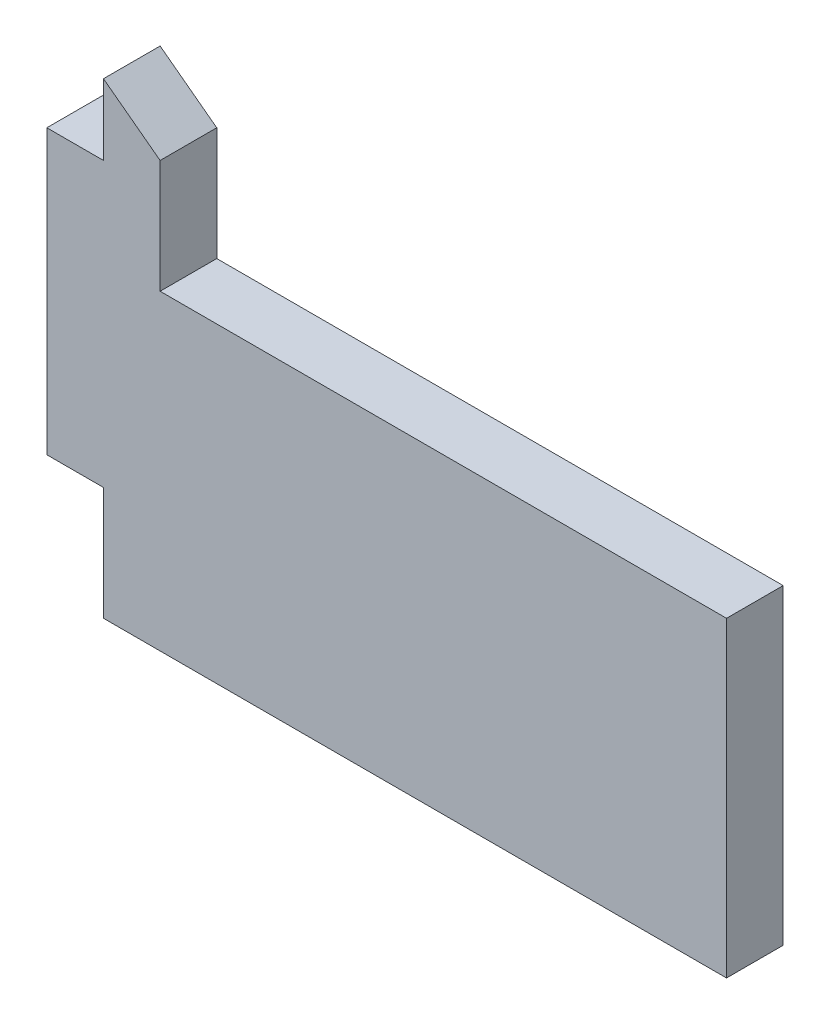
ISO-10303-21;
HEADER;
FILE_DESCRIPTION(('STEP AP214'),'2;1');
FILE_NAME('part.step','',(''),(''),'','','');
FILE_SCHEMA(('AUTOMOTIVE_DESIGN { 1 0 10303 214 1 1 1 1 }'));
ENDSEC;
DATA;
#1=APPLICATION_CONTEXT('core data for automotive mechanical design processes');
#2=APPLICATION_PROTOCOL_DEFINITION('international standard','automotive_design',2000,#1);
#3=PRODUCT_CONTEXT('',#1,'mechanical');
#4=PRODUCT('Part','Part','',(#3));
#5=PRODUCT_RELATED_PRODUCT_CATEGORY('part','',(#4));
#6=PRODUCT_DEFINITION_FORMATION('','',#4);
#7=PRODUCT_DEFINITION_CONTEXT('part definition',#1,'design');
#8=PRODUCT_DEFINITION('design','',#6,#7);
#9=PRODUCT_DEFINITION_SHAPE('','',#8);
#10=(LENGTH_UNIT() NAMED_UNIT(*) SI_UNIT(.MILLI.,.METRE.));
#11=(NAMED_UNIT(*) PLANE_ANGLE_UNIT() SI_UNIT($,.RADIAN.));
#12=(NAMED_UNIT(*) SI_UNIT($,.STERADIAN.) SOLID_ANGLE_UNIT());
#13=UNCERTAINTY_MEASURE_WITH_UNIT(LENGTH_MEASURE(1.E-05),#10,'distance_accuracy_value','');
#14=(GEOMETRIC_REPRESENTATION_CONTEXT(3) GLOBAL_UNCERTAINTY_ASSIGNED_CONTEXT((#13)) GLOBAL_UNIT_ASSIGNED_CONTEXT((#10,
#11,#12)) REPRESENTATION_CONTEXT('',''));
#15=CARTESIAN_POINT('',(0.,0.,0.));
#16=DIRECTION('',(0.,0.,1.));
#17=DIRECTION('',(1.,0.,0.));
#18=AXIS2_PLACEMENT_3D('',#15,#16,#17);
#19=CARTESIAN_POINT('',(2.,0.,2.));
#20=DIRECTION('',(0.,1.,0.));
#21=DIRECTION('',(0.,0.,1.));
#22=AXIS2_PLACEMENT_3D('',#19,#20,#21);
#23=PLANE('',#22);
#24=DIRECTION('',(1.,0.,0.));
#25=VECTOR('',#24,1.);
#26=CARTESIAN_POINT('',(2.,0.,0.));
#27=LINE('',#26,#25);
#28=CARTESIAN_POINT('',(0.,0.,0.));
#29=VERTEX_POINT('',#28);
#30=CARTESIAN_POINT('',(2.,0.,0.));
#31=VERTEX_POINT('',#30);
#32=EDGE_CURVE('E144',#29,#31,#27,.T.);
#33=ORIENTED_EDGE('',*,*,#32,.T.);
#34=DIRECTION('',(0.,0.,-1.));
#35=VECTOR('',#34,1.);
#36=CARTESIAN_POINT('',(2.,0.,2.));
#37=LINE('',#36,#35);
#38=CARTESIAN_POINT('',(2.,0.,2.));
#39=VERTEX_POINT('',#38);
#40=EDGE_CURVE('E11',#39,#31,#37,.T.);
#41=ORIENTED_EDGE('',*,*,#40,.F.);
#42=DIRECTION('',(1.,0.,0.));
#43=VECTOR('',#42,1.);
#44=CARTESIAN_POINT('',(2.,0.,2.));
#45=LINE('',#44,#43);
#46=CARTESIAN_POINT('',(0.,0.,2.));
#47=VERTEX_POINT('',#46);
#48=EDGE_CURVE('E162',#47,#39,#45,.T.);
#49=ORIENTED_EDGE('',*,*,#48,.F.);
#50=DIRECTION('',(0.,0.,-1.));
#51=VECTOR('',#50,1.);
#52=CARTESIAN_POINT('',(0.,0.,2.));
#53=LINE('',#52,#51);
#54=EDGE_CURVE('E140',#47,#29,#53,.T.);
#55=ORIENTED_EDGE('',*,*,#54,.T.);
#56=EDGE_LOOP('',(#33,#41,#49,#55));
#57=FACE_BOUND('',#56,.T.);
#58=ADVANCED_FACE('F36',(#57),#23,.F.);
#59=CARTESIAN_POINT('',(2.,-4.,2.));
#60=DIRECTION('',(1.,0.,0.));
#61=DIRECTION('',(0.,0.,-1.));
#62=AXIS2_PLACEMENT_3D('',#59,#60,#61);
#63=PLANE('',#62);
#64=DIRECTION('',(0.,-1.,0.));
#65=VECTOR('',#64,1.);
#66=CARTESIAN_POINT('',(2.,-4.,0.));
#67=LINE('',#66,#65);
#68=CARTESIAN_POINT('',(2.,-4.,0.));
#69=VERTEX_POINT('',#68);
#70=EDGE_CURVE('E147',#31,#69,#67,.T.);
#71=ORIENTED_EDGE('',*,*,#70,.T.);
#72=DIRECTION('',(0.,0.,-1.));
#73=VECTOR('',#72,1.);
#74=CARTESIAN_POINT('',(2.,-4.,2.));
#75=LINE('',#74,#73);
#76=CARTESIAN_POINT('',(2.,-4.,2.));
#77=VERTEX_POINT('',#76);
#78=EDGE_CURVE('E44',#77,#69,#75,.T.);
#79=ORIENTED_EDGE('',*,*,#78,.F.);
#80=DIRECTION('',(0.,-1.,0.));
#81=VECTOR('',#80,1.);
#82=CARTESIAN_POINT('',(2.,-4.,2.));
#83=LINE('',#82,#81);
#84=EDGE_CURVE('E101',#39,#77,#83,.T.);
#85=ORIENTED_EDGE('',*,*,#84,.F.);
#86=ORIENTED_EDGE('',*,*,#40,.T.);
#87=EDGE_LOOP('',(#71,#79,#85,#86));
#88=FACE_BOUND('',#87,.T.);
#89=ADVANCED_FACE('F211',(#88),#63,.F.);
#90=CARTESIAN_POINT('',(24.,-4.,2.));
#91=DIRECTION('',(0.,1.,0.));
#92=DIRECTION('',(-1.,0.,0.));
#93=AXIS2_PLACEMENT_3D('',#90,#91,#92);
#94=PLANE('',#93);
#95=DIRECTION('',(1.,0.,0.));
#96=VECTOR('',#95,1.);
#97=CARTESIAN_POINT('',(24.,-4.,0.));
#98=LINE('',#97,#96);
#99=CARTESIAN_POINT('',(24.,-4.,0.));
#100=VERTEX_POINT('',#99);
#101=EDGE_CURVE('E149',#69,#100,#98,.T.);
#102=ORIENTED_EDGE('',*,*,#101,.T.);
#103=DIRECTION('',(0.,0.,-1.));
#104=VECTOR('',#103,1.);
#105=CARTESIAN_POINT('',(24.,-4.,2.));
#106=LINE('',#105,#104);
#107=CARTESIAN_POINT('',(24.,-4.,2.));
#108=VERTEX_POINT('',#107);
#109=EDGE_CURVE('E175',#108,#100,#106,.T.);
#110=ORIENTED_EDGE('',*,*,#109,.F.);
#111=DIRECTION('',(1.,0.,0.));
#112=VECTOR('',#111,1.);
#113=CARTESIAN_POINT('',(24.,-4.,2.));
#114=LINE('',#113,#112);
#115=EDGE_CURVE('E183',#77,#108,#114,.T.);
#116=ORIENTED_EDGE('',*,*,#115,.F.);
#117=ORIENTED_EDGE('',*,*,#78,.T.);
#118=EDGE_LOOP('',(#102,#110,#116,#117));
#119=FACE_BOUND('',#118,.T.);
#120=ADVANCED_FACE('F181',(#119),#94,.F.);
#121=CARTESIAN_POINT('',(24.,7.00000000000001,2.));
#122=DIRECTION('',(-1.,0.,0.));
#123=DIRECTION('',(0.,-1.,0.));
#124=AXIS2_PLACEMENT_3D('',#121,#122,#123);
#125=PLANE('',#124);
#126=DIRECTION('',(0.,1.,0.));
#127=VECTOR('',#126,1.);
#128=CARTESIAN_POINT('',(24.,7.00000000000001,0.));
#129=LINE('',#128,#127);
#130=CARTESIAN_POINT('',(24.,7.00000000000001,0.));
#131=VERTEX_POINT('',#130);
#132=EDGE_CURVE('E151',#100,#131,#129,.T.);
#133=ORIENTED_EDGE('',*,*,#132,.T.);
#134=DIRECTION('',(0.,0.,-1.));
#135=VECTOR('',#134,1.);
#136=CARTESIAN_POINT('',(24.,7.00000000000001,2.));
#137=LINE('',#136,#135);
#138=CARTESIAN_POINT('',(24.,7.00000000000001,2.));
#139=VERTEX_POINT('',#138);
#140=EDGE_CURVE('E172',#139,#131,#137,.T.);
#141=ORIENTED_EDGE('',*,*,#140,.F.);
#142=DIRECTION('',(0.,1.,0.));
#143=VECTOR('',#142,1.);
#144=CARTESIAN_POINT('',(24.,7.00000000000001,2.));
#145=LINE('',#144,#143);
#146=EDGE_CURVE('E201',#108,#139,#145,.T.);
#147=ORIENTED_EDGE('',*,*,#146,.F.);
#148=ORIENTED_EDGE('',*,*,#109,.T.);
#149=EDGE_LOOP('',(#133,#141,#147,#148));
#150=FACE_BOUND('',#149,.T.);
#151=ADVANCED_FACE('F192',(#150),#125,.F.);
#152=CARTESIAN_POINT('',(4.,7.00000000000001,2.));
#153=DIRECTION('',(0.,-1.,0.));
#154=DIRECTION('',(0.,0.,-1.));
#155=AXIS2_PLACEMENT_3D('',#152,#153,#154);
#156=PLANE('',#155);
#157=DIRECTION('',(-1.,0.,0.));
#158=VECTOR('',#157,1.);
#159=CARTESIAN_POINT('',(4.,7.00000000000001,0.));
#160=LINE('',#159,#158);
#161=CARTESIAN_POINT('',(4.,7.00000000000001,0.));
#162=VERTEX_POINT('',#161);
#163=EDGE_CURVE('E153',#131,#162,#160,.T.);
#164=ORIENTED_EDGE('',*,*,#163,.T.);
#165=DIRECTION('',(0.,0.,-1.));
#166=VECTOR('',#165,1.);
#167=CARTESIAN_POINT('',(4.,7.00000000000001,2.));
#168=LINE('',#167,#166);
#169=CARTESIAN_POINT('',(4.,7.00000000000001,2.));
#170=VERTEX_POINT('',#169);
#171=EDGE_CURVE('E169',#170,#162,#168,.T.);
#172=ORIENTED_EDGE('',*,*,#171,.F.);
#173=DIRECTION('',(-1.,0.,0.));
#174=VECTOR('',#173,1.);
#175=CARTESIAN_POINT('',(4.,7.00000000000001,2.));
#176=LINE('',#175,#174);
#177=EDGE_CURVE('E198',#139,#170,#176,.T.);
#178=ORIENTED_EDGE('',*,*,#177,.F.);
#179=ORIENTED_EDGE('',*,*,#140,.T.);
#180=EDGE_LOOP('',(#164,#172,#178,#179));
#181=FACE_BOUND('',#180,.T.);
#182=ADVANCED_FACE('F196',(#181),#156,.F.);
#183=CARTESIAN_POINT('',(4.,11.,2.));
#184=DIRECTION('',(-1.,0.,0.));
#185=DIRECTION('',(0.,-1.,0.));
#186=AXIS2_PLACEMENT_3D('',#183,#184,#185);
#187=PLANE('',#186);
#188=DIRECTION('',(0.,1.,0.));
#189=VECTOR('',#188,1.);
#190=CARTESIAN_POINT('',(4.,11.,0.));
#191=LINE('',#190,#189);
#192=CARTESIAN_POINT('',(4.,11.,0.));
#193=VERTEX_POINT('',#192);
#194=EDGE_CURVE('E155',#162,#193,#191,.T.);
#195=ORIENTED_EDGE('',*,*,#194,.T.);
#196=DIRECTION('',(0.,0.,-1.));
#197=VECTOR('',#196,1.);
#198=CARTESIAN_POINT('',(4.,11.,2.));
#199=LINE('',#198,#197);
#200=CARTESIAN_POINT('',(4.,11.,2.));
#201=VERTEX_POINT('',#200);
#202=EDGE_CURVE('E166',#201,#193,#199,.T.);
#203=ORIENTED_EDGE('',*,*,#202,.F.);
#204=DIRECTION('',(0.,1.,0.));
#205=VECTOR('',#204,1.);
#206=CARTESIAN_POINT('',(4.,11.,2.));
#207=LINE('',#206,#205);
#208=EDGE_CURVE('E200',#170,#201,#207,.T.);
#209=ORIENTED_EDGE('',*,*,#208,.F.);
#210=ORIENTED_EDGE('',*,*,#171,.T.);
#211=EDGE_LOOP('',(#195,#203,#209,#210));
#212=FACE_BOUND('',#211,.T.);
#213=ADVANCED_FACE('F223',(#212),#187,.F.);
#214=CARTESIAN_POINT('',(2.,12.5,2.));
#215=DIRECTION('',(-0.6,-0.8,0.));
#216=DIRECTION('',(0.8,-0.6,0.));
#217=AXIS2_PLACEMENT_3D('',#214,#215,#216);
#218=PLANE('',#217);
#219=DIRECTION('',(-0.8,0.6,0.));
#220=VECTOR('',#219,1.);
#221=CARTESIAN_POINT('',(2.,12.5,0.));
#222=LINE('',#221,#220);
#223=CARTESIAN_POINT('',(2.,12.5,0.));
#224=VERTEX_POINT('',#223);
#225=EDGE_CURVE('E157',#193,#224,#222,.T.);
#226=ORIENTED_EDGE('',*,*,#225,.T.);
#227=DIRECTION('',(0.,0.,-1.));
#228=VECTOR('',#227,1.);
#229=CARTESIAN_POINT('',(2.,12.5,2.));
#230=LINE('',#229,#228);
#231=CARTESIAN_POINT('',(2.,12.5,2.));
#232=VERTEX_POINT('',#231);
#233=EDGE_CURVE('E135',#232,#224,#230,.T.);
#234=ORIENTED_EDGE('',*,*,#233,.F.);
#235=DIRECTION('',(-0.8,0.6,0.));
#236=VECTOR('',#235,1.);
#237=CARTESIAN_POINT('',(2.,12.5,2.));
#238=LINE('',#237,#236);
#239=EDGE_CURVE('E126',#201,#232,#238,.T.);
#240=ORIENTED_EDGE('',*,*,#239,.F.);
#241=ORIENTED_EDGE('',*,*,#202,.T.);
#242=EDGE_LOOP('',(#226,#234,#240,#241));
#243=FACE_BOUND('',#242,.T.);
#244=ADVANCED_FACE('F226',(#243),#218,.F.);
#245=CARTESIAN_POINT('',(2.,10.,2.));
#246=DIRECTION('',(1.,0.,0.));
#247=DIRECTION('',(0.,0.,-1.));
#248=AXIS2_PLACEMENT_3D('',#245,#246,#247);
#249=PLANE('',#248);
#250=DIRECTION('',(0.,-1.,0.));
#251=VECTOR('',#250,1.);
#252=CARTESIAN_POINT('',(2.,10.,0.));
#253=LINE('',#252,#251);
#254=CARTESIAN_POINT('',(2.,10.,0.));
#255=VERTEX_POINT('',#254);
#256=EDGE_CURVE('E134',#224,#255,#253,.T.);
#257=ORIENTED_EDGE('',*,*,#256,.T.);
#258=DIRECTION('',(0.,0.,-1.));
#259=VECTOR('',#258,1.);
#260=CARTESIAN_POINT('',(2.,10.,2.));
#261=LINE('',#260,#259);
#262=CARTESIAN_POINT('',(2.,10.,2.));
#263=VERTEX_POINT('',#262);
#264=EDGE_CURVE('E131',#263,#255,#261,.T.);
#265=ORIENTED_EDGE('',*,*,#264,.F.);
#266=DIRECTION('',(0.,-1.,0.));
#267=VECTOR('',#266,1.);
#268=CARTESIAN_POINT('',(2.,10.,2.));
#269=LINE('',#268,#267);
#270=EDGE_CURVE('E120',#232,#263,#269,.T.);
#271=ORIENTED_EDGE('',*,*,#270,.F.);
#272=ORIENTED_EDGE('',*,*,#233,.T.);
#273=EDGE_LOOP('',(#257,#265,#271,#272));
#274=FACE_BOUND('',#273,.T.);
#275=ADVANCED_FACE('F132',(#274),#249,.F.);
#276=CARTESIAN_POINT('',(0.,10.,2.));
#277=DIRECTION('',(0.,-1.,0.));
#278=DIRECTION('',(0.,0.,-1.));
#279=AXIS2_PLACEMENT_3D('',#276,#277,#278);
#280=PLANE('',#279);
#281=DIRECTION('',(-1.,0.,0.));
#282=VECTOR('',#281,1.);
#283=CARTESIAN_POINT('',(0.,10.,0.));
#284=LINE('',#283,#282);
#285=CARTESIAN_POINT('',(0.,10.,0.));
#286=VERTEX_POINT('',#285);
#287=EDGE_CURVE('E87',#255,#286,#284,.T.);
#288=ORIENTED_EDGE('',*,*,#287,.T.);
#289=DIRECTION('',(0.,0.,-1.));
#290=VECTOR('',#289,1.);
#291=CARTESIAN_POINT('',(0.,10.,2.));
#292=LINE('',#291,#290);
#293=CARTESIAN_POINT('',(0.,10.,2.));
#294=VERTEX_POINT('',#293);
#295=EDGE_CURVE('E136',#294,#286,#292,.T.);
#296=ORIENTED_EDGE('',*,*,#295,.F.);
#297=DIRECTION('',(-1.,0.,0.));
#298=VECTOR('',#297,1.);
#299=CARTESIAN_POINT('',(0.,10.,2.));
#300=LINE('',#299,#298);
#301=EDGE_CURVE('E124',#263,#294,#300,.T.);
#302=ORIENTED_EDGE('',*,*,#301,.F.);
#303=ORIENTED_EDGE('',*,*,#264,.T.);
#304=EDGE_LOOP('',(#288,#296,#302,#303));
#305=FACE_BOUND('',#304,.T.);
#306=ADVANCED_FACE('F138',(#305),#280,.F.);
#307=CARTESIAN_POINT('',(0.,0.,2.));
#308=DIRECTION('',(1.,0.,0.));
#309=DIRECTION('',(0.,0.,-1.));
#310=AXIS2_PLACEMENT_3D('',#307,#308,#309);
#311=PLANE('',#310);
#312=DIRECTION('',(0.,-1.,0.));
#313=VECTOR('',#312,1.);
#314=CARTESIAN_POINT('',(0.,0.,0.));
#315=LINE('',#314,#313);
#316=EDGE_CURVE('E93',#286,#29,#315,.T.);
#317=ORIENTED_EDGE('',*,*,#316,.T.);
#318=ORIENTED_EDGE('',*,*,#54,.F.);
#319=DIRECTION('',(0.,-1.,0.));
#320=VECTOR('',#319,1.);
#321=CARTESIAN_POINT('',(0.,0.,2.));
#322=LINE('',#321,#320);
#323=EDGE_CURVE('E52',#294,#47,#322,.T.);
#324=ORIENTED_EDGE('',*,*,#323,.F.);
#325=ORIENTED_EDGE('',*,*,#295,.T.);
#326=EDGE_LOOP('',(#317,#318,#324,#325));
#327=FACE_BOUND('',#326,.T.);
#328=ADVANCED_FACE('F235',(#327),#311,.F.);
#329=CARTESIAN_POINT('',(0.,0.,2.));
#330=DIRECTION('',(0.,0.,-1.));
#331=DIRECTION('',(-1.,0.,0.));
#332=AXIS2_PLACEMENT_3D('',#329,#330,#331);
#333=PLANE('',#332);
#334=ORIENTED_EDGE('',*,*,#48,.T.);
#335=ORIENTED_EDGE('',*,*,#84,.T.);
#336=ORIENTED_EDGE('',*,*,#115,.T.);
#337=ORIENTED_EDGE('',*,*,#146,.T.);
#338=ORIENTED_EDGE('',*,*,#177,.T.);
#339=ORIENTED_EDGE('',*,*,#208,.T.);
#340=ORIENTED_EDGE('',*,*,#239,.T.);
#341=ORIENTED_EDGE('',*,*,#270,.T.);
#342=ORIENTED_EDGE('',*,*,#301,.T.);
#343=ORIENTED_EDGE('',*,*,#323,.T.);
#344=EDGE_LOOP('',(#334,#335,#336,#337,#338,#339,#340,#341,#342,#343));
#345=FACE_BOUND('',#344,.T.);
#346=ADVANCED_FACE('F122',(#345),#333,.F.);
#347=CARTESIAN_POINT('',(0.,0.,0.));
#348=DIRECTION('',(0.,0.,-1.));
#349=DIRECTION('',(-1.,0.,0.));
#350=AXIS2_PLACEMENT_3D('',#347,#348,#349);
#351=PLANE('',#350);
#352=ORIENTED_EDGE('',*,*,#32,.F.);
#353=ORIENTED_EDGE('',*,*,#316,.F.);
#354=ORIENTED_EDGE('',*,*,#287,.F.);
#355=ORIENTED_EDGE('',*,*,#256,.F.);
#356=ORIENTED_EDGE('',*,*,#225,.F.);
#357=ORIENTED_EDGE('',*,*,#194,.F.);
#358=ORIENTED_EDGE('',*,*,#163,.F.);
#359=ORIENTED_EDGE('',*,*,#132,.F.);
#360=ORIENTED_EDGE('',*,*,#101,.F.);
#361=ORIENTED_EDGE('',*,*,#70,.F.);
#362=EDGE_LOOP('',(#352,#353,#354,#355,#356,#357,#358,#359,#360,#361));
#363=FACE_BOUND('',#362,.T.);
#364=ADVANCED_FACE('F187',(#363),#351,.T.);
#365=CLOSED_SHELL('',(#58,#89,#120,#151,#182,#213,#244,#275,#306,#328,#346,#364));
#366=MANIFOLD_SOLID_BREP('B2',#365);
#367=ADVANCED_BREP_SHAPE_REPRESENTATION('',(#18,#366),#14);
#368=SHAPE_DEFINITION_REPRESENTATION(#9,#367);
ENDSEC;
END-ISO-10303-21;
